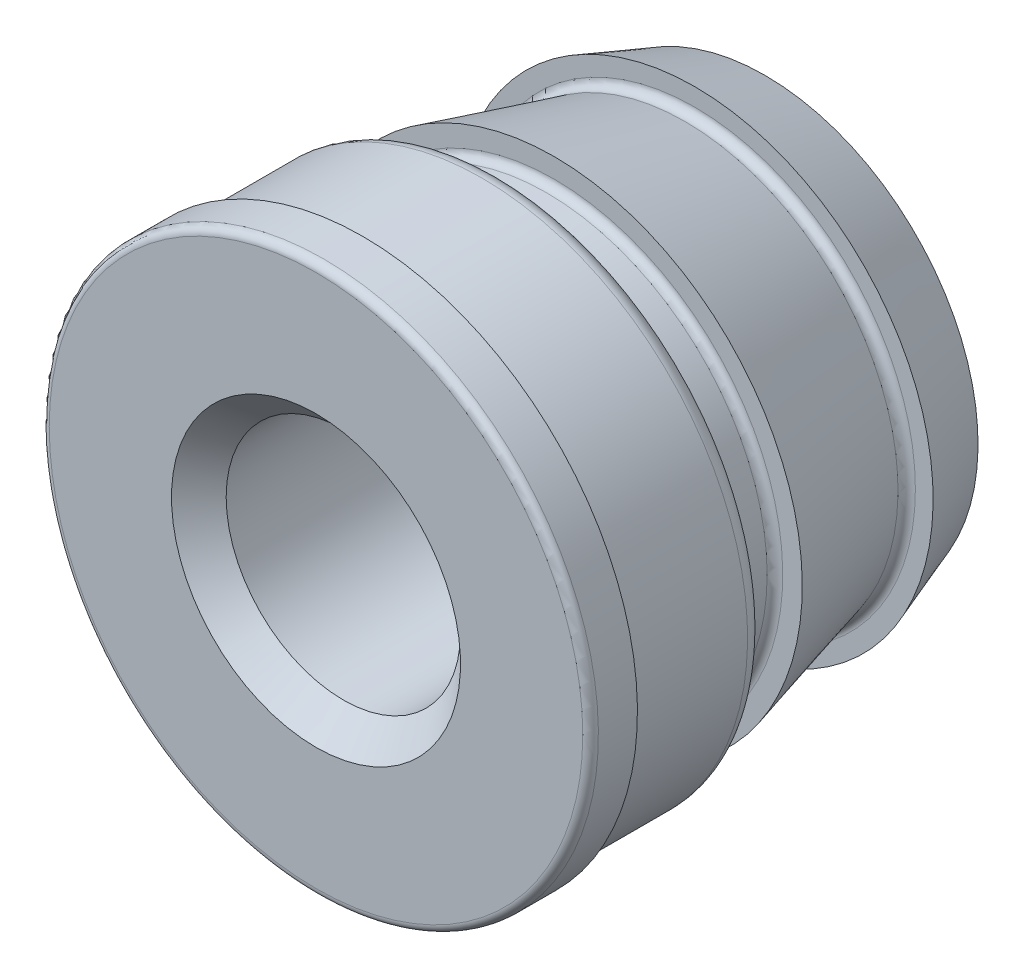
ISO-10303-21;
HEADER;
FILE_DESCRIPTION(('STEP AP214'),'2;1');
FILE_NAME('part.step','',(''),(''),'','','');
FILE_SCHEMA(('AUTOMOTIVE_DESIGN { 1 0 10303 214 1 1 1 1 }'));
ENDSEC;
DATA;
#1=APPLICATION_CONTEXT('core data for automotive mechanical design processes');
#2=APPLICATION_PROTOCOL_DEFINITION('international standard','automotive_design',2000,#1);
#3=PRODUCT_CONTEXT('',#1,'mechanical');
#4=PRODUCT('Part','Part','',(#3));
#5=PRODUCT_RELATED_PRODUCT_CATEGORY('part','',(#4));
#6=PRODUCT_DEFINITION_FORMATION('','',#4);
#7=PRODUCT_DEFINITION_CONTEXT('part definition',#1,'design');
#8=PRODUCT_DEFINITION('design','',#6,#7);
#9=PRODUCT_DEFINITION_SHAPE('','',#8);
#10=(LENGTH_UNIT() NAMED_UNIT(*) SI_UNIT(.MILLI.,.METRE.));
#11=(NAMED_UNIT(*) PLANE_ANGLE_UNIT() SI_UNIT($,.RADIAN.));
#12=(NAMED_UNIT(*) SI_UNIT($,.STERADIAN.) SOLID_ANGLE_UNIT());
#13=UNCERTAINTY_MEASURE_WITH_UNIT(LENGTH_MEASURE(1.E-05),#10,'distance_accuracy_value','');
#14=(GEOMETRIC_REPRESENTATION_CONTEXT(3) GLOBAL_UNCERTAINTY_ASSIGNED_CONTEXT((#13)) GLOBAL_UNIT_ASSIGNED_CONTEXT((#10,
#11,#12)) REPRESENTATION_CONTEXT('',''));
#15=CARTESIAN_POINT('',(0.,0.,0.));
#16=DIRECTION('',(0.,0.,1.));
#17=DIRECTION('',(1.,0.,0.));
#18=AXIS2_PLACEMENT_3D('',#15,#16,#17);
#19=CARTESIAN_POINT('',(0.,0.,0.380999999999999));
#20=DIRECTION('',(0.,0.,-1.));
#21=DIRECTION('',(0.,1.,0.));
#22=AXIS2_PLACEMENT_3D('',#19,#20,#21);
#23=TOROIDAL_SURFACE('',#22,1.6129,0.1143);
#24=CARTESIAN_POINT('',(0.,0.,0.380999999999999));
#25=DIRECTION('',(0.,0.,-1.));
#26=DIRECTION('',(0.,1.,0.));
#27=AXIS2_PLACEMENT_3D('',#24,#25,#26);
#28=CIRCLE('',#27,1.7272);
#29=CARTESIAN_POINT('',(0.,1.7272,0.381));
#30=VERTEX_POINT('',#29);
#31=EDGE_CURVE('E118',#30,#30,#28,.T.);
#32=ORIENTED_EDGE('',*,*,#31,.T.);
#33=EDGE_LOOP('',(#32));
#34=FACE_BOUND('',#33,.T.);
#35=CARTESIAN_POINT('',(0.,0.,0.266699999999999));
#36=DIRECTION('',(0.,0.,-1.));
#37=DIRECTION('',(0.,1.,0.));
#38=AXIS2_PLACEMENT_3D('',#35,#36,#37);
#39=CIRCLE('',#38,1.6129);
#40=CARTESIAN_POINT('',(0.,1.6129,0.2667));
#41=VERTEX_POINT('',#40);
#42=EDGE_CURVE('E10',#41,#41,#39,.T.);
#43=ORIENTED_EDGE('',*,*,#42,.F.);
#44=EDGE_LOOP('',(#43));
#45=FACE_BOUND('',#44,.T.);
#46=ADVANCED_FACE('F39',(#34,#45),#23,.T.);
#47=CARTESIAN_POINT('',(0.,1.6129,0.266699999999999));
#48=DIRECTION('',(0.,0.,-1.));
#49=DIRECTION('',(0.,1.,0.));
#50=AXIS2_PLACEMENT_3D('',#47,#48,#49);
#51=PLANE('',#50);
#52=ORIENTED_EDGE('',*,*,#42,.T.);
#53=EDGE_LOOP('',(#52));
#54=FACE_BOUND('',#53,.T.);
#55=CARTESIAN_POINT('',(0.,0.,0.266699999999999));
#56=DIRECTION('',(0.,0.,-1.));
#57=DIRECTION('',(0.,1.,0.));
#58=AXIS2_PLACEMENT_3D('',#55,#56,#57);
#59=CIRCLE('',#58,1.4859);
#60=CARTESIAN_POINT('',(0.,1.4859,0.266699999999999));
#61=VERTEX_POINT('',#60);
#62=EDGE_CURVE('E46',#61,#61,#59,.T.);
#63=ORIENTED_EDGE('',*,*,#62,.F.);
#64=EDGE_LOOP('',(#63));
#65=FACE_BOUND('',#64,.T.);
#66=ADVANCED_FACE('F137',(#54,#65),#51,.T.);
#67=CARTESIAN_POINT('',(0.,0.,0.215899999999999));
#68=DIRECTION('',(0.,0.,-1.));
#69=DIRECTION('',(0.,1.,0.));
#70=AXIS2_PLACEMENT_3D('',#67,#68,#69);
#71=TOROIDAL_SURFACE('',#70,1.4859,0.0508);
#72=ORIENTED_EDGE('',*,*,#62,.T.);
#73=EDGE_LOOP('',(#72));
#74=FACE_BOUND('',#73,.T.);
#75=CARTESIAN_POINT('',(0.,0.,0.215899999999999));
#76=DIRECTION('',(0.,0.,-1.));
#77=DIRECTION('',(0.,1.,0.));
#78=AXIS2_PLACEMENT_3D('',#75,#76,#77);
#79=CIRCLE('',#78,1.4351);
#80=CARTESIAN_POINT('',(0.,1.4351,0.215899999999999));
#81=VERTEX_POINT('',#80);
#82=EDGE_CURVE('E51',#81,#81,#79,.T.);
#83=ORIENTED_EDGE('',*,*,#82,.F.);
#84=EDGE_LOOP('',(#83));
#85=FACE_BOUND('',#84,.T.);
#86=ADVANCED_FACE('F141',(#74,#85),#71,.F.);
#87=CARTESIAN_POINT('',(0.,0.,-1.4605));
#88=DIRECTION('',(0.,0.,-1.));
#89=DIRECTION('',(0.,1.,0.));
#90=AXIS2_PLACEMENT_3D('',#87,#88,#89);
#91=CYLINDRICAL_SURFACE('',#90,1.4351);
#92=ORIENTED_EDGE('',*,*,#82,.T.);
#93=EDGE_LOOP('',(#92));
#94=FACE_BOUND('',#93,.T.);
#95=CARTESIAN_POINT('',(0.,0.,-0.0381000000000008));
#96=DIRECTION('',(0.,0.,-1.));
#97=DIRECTION('',(0.,1.,0.));
#98=AXIS2_PLACEMENT_3D('',#95,#96,#97);
#99=CIRCLE('',#98,1.4351);
#100=CARTESIAN_POINT('',(0.,1.4351,-0.0381000000000003));
#101=VERTEX_POINT('',#100);
#102=EDGE_CURVE('E56',#101,#101,#99,.T.);
#103=ORIENTED_EDGE('',*,*,#102,.F.);
#104=EDGE_LOOP('',(#103));
#105=FACE_BOUND('',#104,.T.);
#106=ADVANCED_FACE('F145',(#94,#105),#91,.T.);
#107=CARTESIAN_POINT('',(0.,0.,-0.038100000000001));
#108=DIRECTION('',(0.,0.,-1.));
#109=DIRECTION('',(0.,1.,0.));
#110=AXIS2_PLACEMENT_3D('',#107,#108,#109);
#111=TOROIDAL_SURFACE('',#110,1.4859,0.0508);
#112=ORIENTED_EDGE('',*,*,#102,.T.);
#113=EDGE_LOOP('',(#112));
#114=FACE_BOUND('',#113,.T.);
#115=CARTESIAN_POINT('',(0.,0.,-0.0889000000000011));
#116=DIRECTION('',(0.,0.,-1.));
#117=DIRECTION('',(0.,1.,0.));
#118=AXIS2_PLACEMENT_3D('',#115,#116,#117);
#119=CIRCLE('',#118,1.4859);
#120=CARTESIAN_POINT('',(0.,1.4859,-0.0889000000000007));
#121=VERTEX_POINT('',#120);
#122=EDGE_CURVE('E62',#121,#121,#119,.T.);
#123=ORIENTED_EDGE('',*,*,#122,.F.);
#124=EDGE_LOOP('',(#123));
#125=FACE_BOUND('',#124,.T.);
#126=ADVANCED_FACE('F151',(#114,#125),#111,.F.);
#127=CARTESIAN_POINT('',(0.,1.4859,-0.0889000000000007));
#128=DIRECTION('',(0.,0.,1.));
#129=DIRECTION('',(0.,-1.,0.));
#130=AXIS2_PLACEMENT_3D('',#127,#128,#129);
#131=PLANE('',#130);
#132=ORIENTED_EDGE('',*,*,#122,.T.);
#133=EDGE_LOOP('',(#132));
#134=FACE_BOUND('',#133,.T.);
#135=CARTESIAN_POINT('',(0.,0.,-0.0889000000000011));
#136=DIRECTION('',(0.,0.,-1.));
#137=DIRECTION('',(0.,1.,0.));
#138=AXIS2_PLACEMENT_3D('',#135,#136,#137);
#139=CIRCLE('',#138,1.6129);
#140=CARTESIAN_POINT('',(0.,1.6129,-0.0889000000000006));
#141=VERTEX_POINT('',#140);
#142=EDGE_CURVE('E66',#141,#141,#139,.T.);
#143=ORIENTED_EDGE('',*,*,#142,.F.);
#144=EDGE_LOOP('',(#143));
#145=FACE_BOUND('',#144,.T.);
#146=ADVANCED_FACE('F155',(#134,#145),#131,.T.);
#147=CARTESIAN_POINT('',(0.,0.,-0.939351992508793));
#148=DIRECTION('',(0.,0.,1.));
#149=DIRECTION('',(0.,-1.,0.));
#150=AXIS2_PLACEMENT_3D('',#147,#148,#149);
#151=CONICAL_SURFACE('',#150,1.38502207540584,0.261799387799143);
#152=ORIENTED_EDGE('',*,*,#142,.T.);
#153=EDGE_LOOP('',(#152));
#154=FACE_BOUND('',#153,.T.);
#155=CARTESIAN_POINT('',(0.,0.,-0.939351992508793));
#156=DIRECTION('',(0.,0.,-1.));
#157=DIRECTION('',(0.,1.,0.));
#158=AXIS2_PLACEMENT_3D('',#155,#156,#157);
#159=CIRCLE('',#158,1.38502207540584);
#160=CARTESIAN_POINT('',(0.,1.38502207540584,-0.939351992508792));
#161=VERTEX_POINT('',#160);
#162=EDGE_CURVE('E70',#161,#161,#159,.T.);
#163=ORIENTED_EDGE('',*,*,#162,.F.);
#164=EDGE_LOOP('',(#163));
#165=FACE_BOUND('',#164,.T.);
#166=ADVANCED_FACE('F159',(#154,#165),#151,.T.);
#167=CARTESIAN_POINT('',(0.,0.,-0.952500000000001));
#168=DIRECTION('',(0.,0.,-1.));
#169=DIRECTION('',(0.,1.,0.));
#170=AXIS2_PLACEMENT_3D('',#167,#168,#169);
#171=TOROIDAL_SURFACE('',#170,1.43409110738132,0.0508);
#172=ORIENTED_EDGE('',*,*,#162,.T.);
#173=EDGE_LOOP('',(#172));
#174=FACE_BOUND('',#173,.T.);
#175=CARTESIAN_POINT('',(0.,0.,-1.0033));
#176=DIRECTION('',(0.,0.,-1.));
#177=DIRECTION('',(0.,1.,0.));
#178=AXIS2_PLACEMENT_3D('',#175,#176,#177);
#179=CIRCLE('',#178,1.43409110738132);
#180=CARTESIAN_POINT('',(0.,1.43409110738132,-1.0033));
#181=VERTEX_POINT('',#180);
#182=EDGE_CURVE('E74',#181,#181,#179,.T.);
#183=ORIENTED_EDGE('',*,*,#182,.F.);
#184=EDGE_LOOP('',(#183));
#185=FACE_BOUND('',#184,.T.);
#186=ADVANCED_FACE('F163',(#174,#185),#171,.F.);
#187=CARTESIAN_POINT('',(0.,1.43409110738132,-1.0033));
#188=DIRECTION('',(0.,0.,1.));
#189=DIRECTION('',(0.,-1.,0.));
#190=AXIS2_PLACEMENT_3D('',#187,#188,#189);
#191=PLANE('',#190);
#192=ORIENTED_EDGE('',*,*,#182,.T.);
#193=EDGE_LOOP('',(#192));
#194=FACE_BOUND('',#193,.T.);
#195=CARTESIAN_POINT('',(0.,0.,-1.0033));
#196=DIRECTION('',(0.,0.,-1.));
#197=DIRECTION('',(0.,1.,0.));
#198=AXIS2_PLACEMENT_3D('',#195,#196,#197);
#199=CIRCLE('',#198,1.5494);
#200=CARTESIAN_POINT('',(0.,1.5494,-1.0033));
#201=VERTEX_POINT('',#200);
#202=EDGE_CURVE('E78',#201,#201,#199,.T.);
#203=ORIENTED_EDGE('',*,*,#202,.F.);
#204=EDGE_LOOP('',(#203));
#205=FACE_BOUND('',#204,.T.);
#206=ADVANCED_FACE('F167',(#194,#205),#191,.T.);
#207=CARTESIAN_POINT('',(0.,0.,-1.4605));
#208=DIRECTION('',(0.,0.,1.));
#209=DIRECTION('',(0.,-1.,0.));
#210=AXIS2_PLACEMENT_3D('',#207,#208,#209);
#211=CONICAL_SURFACE('',#210,1.3843,0.346538864433942);
#212=ORIENTED_EDGE('',*,*,#202,.T.);
#213=EDGE_LOOP('',(#212));
#214=FACE_BOUND('',#213,.T.);
#215=CARTESIAN_POINT('',(0.,0.,-1.4605));
#216=DIRECTION('',(0.,0.,-1.));
#217=DIRECTION('',(0.,1.,0.));
#218=AXIS2_PLACEMENT_3D('',#215,#216,#217);
#219=CIRCLE('',#218,1.3843);
#220=CARTESIAN_POINT('',(0.,1.3843,-1.4605));
#221=VERTEX_POINT('',#220);
#222=EDGE_CURVE('E82',#221,#221,#219,.T.);
#223=ORIENTED_EDGE('',*,*,#222,.F.);
#224=EDGE_LOOP('',(#223));
#225=FACE_BOUND('',#224,.T.);
#226=ADVANCED_FACE('F171',(#214,#225),#211,.T.);
#227=CARTESIAN_POINT('',(0.,1.3843,-1.4605));
#228=DIRECTION('',(0.,0.,-1.));
#229=DIRECTION('',(0.,1.,0.));
#230=AXIS2_PLACEMENT_3D('',#227,#228,#229);
#231=PLANE('',#230);
#232=ORIENTED_EDGE('',*,*,#222,.T.);
#233=EDGE_LOOP('',(#232));
#234=FACE_BOUND('',#233,.T.);
#235=CARTESIAN_POINT('',(0.,0.,-1.4605));
#236=DIRECTION('',(0.,0.,-1.));
#237=DIRECTION('',(0.,1.,0.));
#238=AXIS2_PLACEMENT_3D('',#235,#236,#237);
#239=CIRCLE('',#238,0.9398);
#240=CARTESIAN_POINT('',(0.,0.9398,-1.4605));
#241=VERTEX_POINT('',#240);
#242=EDGE_CURVE('E86',#241,#241,#239,.T.);
#243=ORIENTED_EDGE('',*,*,#242,.F.);
#244=EDGE_LOOP('',(#243));
#245=FACE_BOUND('',#244,.T.);
#246=ADVANCED_FACE('F175',(#234,#245),#231,.T.);
#247=CARTESIAN_POINT('',(0.,0.,-1.2827));
#248=DIRECTION('',(0.,0.,-1.));
#249=DIRECTION('',(0.,1.,0.));
#250=AXIS2_PLACEMENT_3D('',#247,#248,#249);
#251=CONICAL_SURFACE('',#250,0.762,0.785398163397444);
#252=ORIENTED_EDGE('',*,*,#242,.T.);
#253=EDGE_LOOP('',(#252));
#254=FACE_BOUND('',#253,.T.);
#255=CARTESIAN_POINT('',(0.,0.,-1.2827));
#256=DIRECTION('',(0.,0.,-1.));
#257=DIRECTION('',(0.,1.,0.));
#258=AXIS2_PLACEMENT_3D('',#255,#256,#257);
#259=CIRCLE('',#258,0.762);
#260=CARTESIAN_POINT('',(0.,0.762,-1.2827));
#261=VERTEX_POINT('',#260);
#262=EDGE_CURVE('E90',#261,#261,#259,.T.);
#263=ORIENTED_EDGE('',*,*,#262,.F.);
#264=EDGE_LOOP('',(#263));
#265=FACE_BOUND('',#264,.T.);
#266=ADVANCED_FACE('F179',(#254,#265),#251,.F.);
#267=CARTESIAN_POINT('',(0.,0.,-1.4605));
#268=DIRECTION('',(0.,0.,-1.));
#269=DIRECTION('',(0.,1.,0.));
#270=AXIS2_PLACEMENT_3D('',#267,#268,#269);
#271=CYLINDRICAL_SURFACE('',#270,0.762);
#272=ORIENTED_EDGE('',*,*,#262,.T.);
#273=EDGE_LOOP('',(#272));
#274=FACE_BOUND('',#273,.T.);
#275=CARTESIAN_POINT('',(0.,0.,1.2827));
#276=DIRECTION('',(0.,0.,-1.));
#277=DIRECTION('',(0.,1.,0.));
#278=AXIS2_PLACEMENT_3D('',#275,#276,#277);
#279=CIRCLE('',#278,0.762);
#280=CARTESIAN_POINT('',(0.,0.762,1.2827));
#281=VERTEX_POINT('',#280);
#282=EDGE_CURVE('E94',#281,#281,#279,.T.);
#283=ORIENTED_EDGE('',*,*,#282,.F.);
#284=EDGE_LOOP('',(#283));
#285=FACE_BOUND('',#284,.T.);
#286=ADVANCED_FACE('F183',(#274,#285),#271,.F.);
#287=CARTESIAN_POINT('',(0.,0.,1.4605));
#288=DIRECTION('',(0.,0.,1.));
#289=DIRECTION('',(0.,-1.,0.));
#290=AXIS2_PLACEMENT_3D('',#287,#288,#289);
#291=CONICAL_SURFACE('',#290,0.939800000000001,0.785398163397453);
#292=ORIENTED_EDGE('',*,*,#282,.T.);
#293=EDGE_LOOP('',(#292));
#294=FACE_BOUND('',#293,.T.);
#295=CARTESIAN_POINT('',(0.,0.,1.4605));
#296=DIRECTION('',(0.,0.,-1.));
#297=DIRECTION('',(0.,1.,0.));
#298=AXIS2_PLACEMENT_3D('',#295,#296,#297);
#299=CIRCLE('',#298,0.939800000000001);
#300=CARTESIAN_POINT('',(0.,0.9398,1.4605));
#301=VERTEX_POINT('',#300);
#302=EDGE_CURVE('E98',#301,#301,#299,.T.);
#303=ORIENTED_EDGE('',*,*,#302,.F.);
#304=EDGE_LOOP('',(#303));
#305=FACE_BOUND('',#304,.T.);
#306=ADVANCED_FACE('F187',(#294,#305),#291,.F.);
#307=CARTESIAN_POINT('',(0.,0.9398,1.4605));
#308=DIRECTION('',(0.,0.,1.));
#309=DIRECTION('',(0.,-1.,0.));
#310=AXIS2_PLACEMENT_3D('',#307,#308,#309);
#311=PLANE('',#310);
#312=ORIENTED_EDGE('',*,*,#302,.T.);
#313=EDGE_LOOP('',(#312));
#314=FACE_BOUND('',#313,.T.);
#315=CARTESIAN_POINT('',(0.,0.,1.4605));
#316=DIRECTION('',(0.,0.,-1.));
#317=DIRECTION('',(0.,1.,0.));
#318=AXIS2_PLACEMENT_3D('',#315,#316,#317);
#319=CIRCLE('',#318,1.73482);
#320=CARTESIAN_POINT('',(0.,1.73482,1.4605));
#321=VERTEX_POINT('',#320);
#322=EDGE_CURVE('E102',#321,#321,#319,.T.);
#323=ORIENTED_EDGE('',*,*,#322,.F.);
#324=EDGE_LOOP('',(#323));
#325=FACE_BOUND('',#324,.T.);
#326=ADVANCED_FACE('F191',(#314,#325),#311,.T.);
#327=CARTESIAN_POINT('',(0.,0.,1.4097));
#328=DIRECTION('',(0.,0.,-1.));
#329=DIRECTION('',(0.,1.,0.));
#330=AXIS2_PLACEMENT_3D('',#327,#328,#329);
#331=TOROIDAL_SURFACE('',#330,1.73482,0.0507999999999999);
#332=ORIENTED_EDGE('',*,*,#322,.T.);
#333=EDGE_LOOP('',(#332));
#334=FACE_BOUND('',#333,.T.);
#335=CARTESIAN_POINT('',(0.,0.,1.4097));
#336=DIRECTION('',(0.,0.,-1.));
#337=DIRECTION('',(0.,1.,0.));
#338=AXIS2_PLACEMENT_3D('',#335,#336,#337);
#339=CIRCLE('',#338,1.78562);
#340=CARTESIAN_POINT('',(0.,1.78562,1.4097));
#341=VERTEX_POINT('',#340);
#342=EDGE_CURVE('E106',#341,#341,#339,.T.);
#343=ORIENTED_EDGE('',*,*,#342,.F.);
#344=EDGE_LOOP('',(#343));
#345=FACE_BOUND('',#344,.T.);
#346=ADVANCED_FACE('F195',(#334,#345),#331,.T.);
#347=CARTESIAN_POINT('',(0.,0.,-1.4605));
#348=DIRECTION('',(0.,0.,-1.));
#349=DIRECTION('',(0.,1.,0.));
#350=AXIS2_PLACEMENT_3D('',#347,#348,#349);
#351=CYLINDRICAL_SURFACE('',#350,1.78562);
#352=ORIENTED_EDGE('',*,*,#342,.T.);
#353=EDGE_LOOP('',(#352));
#354=FACE_BOUND('',#353,.T.);
#355=CARTESIAN_POINT('',(0.,0.,1.1557));
#356=DIRECTION('',(0.,0.,-1.));
#357=DIRECTION('',(0.,1.,0.));
#358=AXIS2_PLACEMENT_3D('',#355,#356,#357);
#359=CIRCLE('',#358,1.78562);
#360=CARTESIAN_POINT('',(0.,1.78562,1.1557));
#361=VERTEX_POINT('',#360);
#362=EDGE_CURVE('E110',#361,#361,#359,.T.);
#363=ORIENTED_EDGE('',*,*,#362,.F.);
#364=EDGE_LOOP('',(#363));
#365=FACE_BOUND('',#364,.T.);
#366=ADVANCED_FACE('F133',(#354,#365),#351,.T.);
#367=CARTESIAN_POINT('',(0.,1.78562,1.1557));
#368=DIRECTION('',(0.,0.,-1.));
#369=DIRECTION('',(0.,1.,0.));
#370=AXIS2_PLACEMENT_3D('',#367,#368,#369);
#371=PLANE('',#370);
#372=ORIENTED_EDGE('',*,*,#362,.T.);
#373=EDGE_LOOP('',(#372));
#374=FACE_BOUND('',#373,.T.);
#375=CARTESIAN_POINT('',(0.,0.,1.1557));
#376=DIRECTION('',(0.,0.,-1.));
#377=DIRECTION('',(0.,1.,0.));
#378=AXIS2_PLACEMENT_3D('',#375,#376,#377);
#379=CIRCLE('',#378,1.7272);
#380=CARTESIAN_POINT('',(0.,1.7272,1.1557));
#381=VERTEX_POINT('',#380);
#382=EDGE_CURVE('E114',#381,#381,#379,.T.);
#383=ORIENTED_EDGE('',*,*,#382,.F.);
#384=EDGE_LOOP('',(#383));
#385=FACE_BOUND('',#384,.T.);
#386=ADVANCED_FACE('F127',(#374,#385),#371,.T.);
#387=CARTESIAN_POINT('',(0.,0.,-1.4605));
#388=DIRECTION('',(0.,0.,-1.));
#389=DIRECTION('',(0.,1.,0.));
#390=AXIS2_PLACEMENT_3D('',#387,#388,#389);
#391=CYLINDRICAL_SURFACE('',#390,1.7272);
#392=ORIENTED_EDGE('',*,*,#382,.T.);
#393=EDGE_LOOP('',(#392));
#394=FACE_BOUND('',#393,.T.);
#395=ORIENTED_EDGE('',*,*,#31,.F.);
#396=EDGE_LOOP('',(#395));
#397=FACE_BOUND('',#396,.T.);
#398=ADVANCED_FACE('F125',(#394,#397),#391,.T.);
#399=CLOSED_SHELL('',(#46,#66,#86,#106,#126,#146,#166,#186,#206,#226,#246,#266,#286,#306,#326,
#346,#366,#386,#398));
#400=MANIFOLD_SOLID_BREP('B2',#399);
#401=ADVANCED_BREP_SHAPE_REPRESENTATION('',(#18,#400),#14);
#402=SHAPE_DEFINITION_REPRESENTATION(#9,#401);
ENDSEC;
END-ISO-10303-21;
